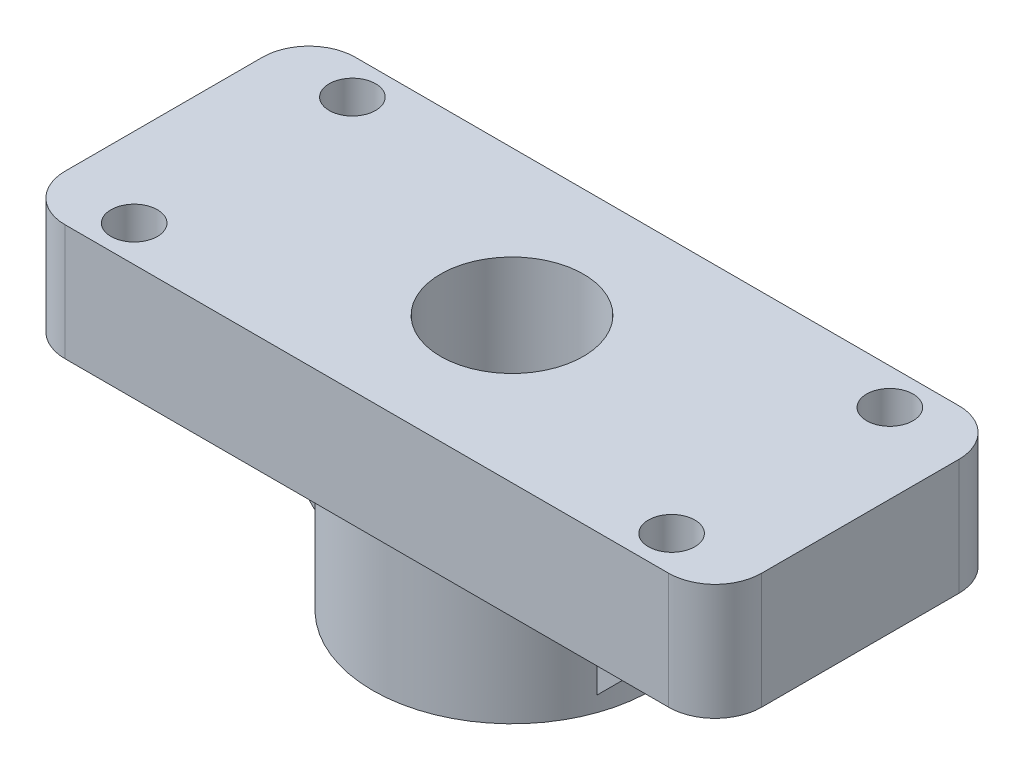
ISO-10303-21;
HEADER;
FILE_DESCRIPTION(('STEP AP214'),'2;1');
FILE_NAME('part.step','',(''),(''),'','','');
FILE_SCHEMA(('AUTOMOTIVE_DESIGN { 1 0 10303 214 1 1 1 1 }'));
ENDSEC;
DATA;
#1=APPLICATION_CONTEXT('core data for automotive mechanical design processes');
#2=APPLICATION_PROTOCOL_DEFINITION('international standard','automotive_design',2000,#1);
#3=PRODUCT_CONTEXT('',#1,'mechanical');
#4=PRODUCT('Part','Part','',(#3));
#5=PRODUCT_RELATED_PRODUCT_CATEGORY('part','',(#4));
#6=PRODUCT_DEFINITION_FORMATION('','',#4);
#7=PRODUCT_DEFINITION_CONTEXT('part definition',#1,'design');
#8=PRODUCT_DEFINITION('design','',#6,#7);
#9=PRODUCT_DEFINITION_SHAPE('','',#8);
#10=(LENGTH_UNIT() NAMED_UNIT(*) SI_UNIT(.MILLI.,.METRE.));
#11=(NAMED_UNIT(*) PLANE_ANGLE_UNIT() SI_UNIT($,.RADIAN.));
#12=(NAMED_UNIT(*) SI_UNIT($,.STERADIAN.) SOLID_ANGLE_UNIT());
#13=UNCERTAINTY_MEASURE_WITH_UNIT(LENGTH_MEASURE(1.E-05),#10,'distance_accuracy_value','');
#14=(GEOMETRIC_REPRESENTATION_CONTEXT(3) GLOBAL_UNCERTAINTY_ASSIGNED_CONTEXT((#13)) GLOBAL_UNIT_ASSIGNED_CONTEXT((#10,
#11,#12)) REPRESENTATION_CONTEXT('',''));
#15=CARTESIAN_POINT('',(0.,0.,0.));
#16=DIRECTION('',(0.,0.,1.));
#17=DIRECTION('',(1.,0.,0.));
#18=AXIS2_PLACEMENT_3D('',#15,#16,#17);
#19=CARTESIAN_POINT('',(-30.,10.,-12.5));
#20=DIRECTION('',(1.,0.,0.));
#21=DIRECTION('',(0.,0.,-1.));
#22=AXIS2_PLACEMENT_3D('',#19,#20,#21);
#23=PLANE('',#22);
#24=DIRECTION('',(0.,0.,1.));
#25=VECTOR('',#24,1.);
#26=CARTESIAN_POINT('',(-30.,10.,-12.5));
#27=LINE('',#26,#25);
#28=CARTESIAN_POINT('',(-30.,10.,-8.5));
#29=VERTEX_POINT('',#28);
#30=CARTESIAN_POINT('',(-30.,10.,8.5));
#31=VERTEX_POINT('',#30);
#32=EDGE_CURVE('E195',#29,#31,#27,.T.);
#33=ORIENTED_EDGE('',*,*,#32,.F.);
#34=DIRECTION('',(0.,-1.,0.));
#35=VECTOR('',#34,1.);
#36=CARTESIAN_POINT('',(-30.,10.,-8.5));
#37=LINE('',#36,#35);
#38=CARTESIAN_POINT('',(-30.,0.,-8.5));
#39=VERTEX_POINT('',#38);
#40=EDGE_CURVE('E230',#29,#39,#37,.T.);
#41=ORIENTED_EDGE('',*,*,#40,.T.);
#42=DIRECTION('',(0.,0.,1.));
#43=VECTOR('',#42,1.);
#44=CARTESIAN_POINT('',(-30.,0.,-12.5));
#45=LINE('',#44,#43);
#46=CARTESIAN_POINT('',(-30.,0.,8.5));
#47=VERTEX_POINT('',#46);
#48=EDGE_CURVE('E194',#39,#47,#45,.T.);
#49=ORIENTED_EDGE('',*,*,#48,.T.);
#50=DIRECTION('',(0.,-1.,0.));
#51=VECTOR('',#50,1.);
#52=CARTESIAN_POINT('',(-30.,10.,8.5));
#53=LINE('',#52,#51);
#54=EDGE_CURVE('E228',#47,#31,#53,.F.);
#55=ORIENTED_EDGE('',*,*,#54,.T.);
#56=EDGE_LOOP('',(#33,#41,#49,#55));
#57=FACE_BOUND('',#56,.T.);
#58=ADVANCED_FACE('F33',(#57),#23,.F.);
#59=CARTESIAN_POINT('',(-30.,10.,12.5));
#60=DIRECTION('',(0.,0.,-1.));
#61=DIRECTION('',(-1.,0.,0.));
#62=AXIS2_PLACEMENT_3D('',#59,#60,#61);
#63=PLANE('',#62);
#64=DIRECTION('',(1.,0.,0.));
#65=VECTOR('',#64,1.);
#66=CARTESIAN_POINT('',(-30.,0.,12.5));
#67=LINE('',#66,#65);
#68=CARTESIAN_POINT('',(-26.,0.,12.5));
#69=VERTEX_POINT('',#68);
#70=CARTESIAN_POINT('',(26.,0.,12.5));
#71=VERTEX_POINT('',#70);
#72=EDGE_CURVE('E209',#69,#71,#67,.T.);
#73=ORIENTED_EDGE('',*,*,#72,.T.);
#74=DIRECTION('',(0.,-1.,0.));
#75=VECTOR('',#74,1.);
#76=CARTESIAN_POINT('',(26.,10.,12.5));
#77=LINE('',#76,#75);
#78=CARTESIAN_POINT('',(26.,10.,12.5));
#79=VERTEX_POINT('',#78);
#80=EDGE_CURVE('E260',#71,#79,#77,.F.);
#81=ORIENTED_EDGE('',*,*,#80,.T.);
#82=DIRECTION('',(1.,0.,0.));
#83=VECTOR('',#82,1.);
#84=CARTESIAN_POINT('',(-30.,10.,12.5));
#85=LINE('',#84,#83);
#86=CARTESIAN_POINT('',(-26.,10.,12.5));
#87=VERTEX_POINT('',#86);
#88=EDGE_CURVE('E198',#87,#79,#85,.T.);
#89=ORIENTED_EDGE('',*,*,#88,.F.);
#90=DIRECTION('',(0.,-1.,0.));
#91=VECTOR('',#90,1.);
#92=CARTESIAN_POINT('',(-26.,10.,12.5));
#93=LINE('',#92,#91);
#94=EDGE_CURVE('E257',#87,#69,#93,.T.);
#95=ORIENTED_EDGE('',*,*,#94,.T.);
#96=EDGE_LOOP('',(#73,#81,#89,#95));
#97=FACE_BOUND('',#96,.T.);
#98=ADVANCED_FACE('F293',(#97),#63,.F.);
#99=CARTESIAN_POINT('',(30.,10.,-12.5));
#100=DIRECTION('',(-1.,0.,0.));
#101=DIRECTION('',(0.,0.,1.));
#102=AXIS2_PLACEMENT_3D('',#99,#100,#101);
#103=PLANE('',#102);
#104=DIRECTION('',(0.,0.,-1.));
#105=VECTOR('',#104,1.);
#106=CARTESIAN_POINT('',(30.,10.,-12.5));
#107=LINE('',#106,#105);
#108=CARTESIAN_POINT('',(30.,10.,8.5));
#109=VERTEX_POINT('',#108);
#110=CARTESIAN_POINT('',(30.,10.,-8.49999999999999));
#111=VERTEX_POINT('',#110);
#112=EDGE_CURVE('E201',#109,#111,#107,.T.);
#113=ORIENTED_EDGE('',*,*,#112,.F.);
#114=DIRECTION('',(0.,-1.,0.));
#115=VECTOR('',#114,1.);
#116=CARTESIAN_POINT('',(30.,10.,8.5));
#117=LINE('',#116,#115);
#118=CARTESIAN_POINT('',(30.,0.,8.5));
#119=VERTEX_POINT('',#118);
#120=EDGE_CURVE('E254',#109,#119,#117,.T.);
#121=ORIENTED_EDGE('',*,*,#120,.T.);
#122=DIRECTION('',(0.,0.,-1.));
#123=VECTOR('',#122,1.);
#124=CARTESIAN_POINT('',(30.,0.,-12.5));
#125=LINE('',#124,#123);
#126=CARTESIAN_POINT('',(30.,0.,-8.49999999999999));
#127=VERTEX_POINT('',#126);
#128=EDGE_CURVE('E212',#119,#127,#125,.T.);
#129=ORIENTED_EDGE('',*,*,#128,.T.);
#130=DIRECTION('',(0.,-1.,0.));
#131=VECTOR('',#130,1.);
#132=CARTESIAN_POINT('',(30.,10.,-8.49999999999999));
#133=LINE('',#132,#131);
#134=EDGE_CURVE('E48',#127,#111,#133,.F.);
#135=ORIENTED_EDGE('',*,*,#134,.T.);
#136=EDGE_LOOP('',(#113,#121,#129,#135));
#137=FACE_BOUND('',#136,.T.);
#138=ADVANCED_FACE('F299',(#137),#103,.F.);
#139=CARTESIAN_POINT('',(-30.,10.,-12.5));
#140=DIRECTION('',(0.,0.,1.));
#141=DIRECTION('',(1.,0.,0.));
#142=AXIS2_PLACEMENT_3D('',#139,#140,#141);
#143=PLANE('',#142);
#144=DIRECTION('',(-1.,0.,0.));
#145=VECTOR('',#144,1.);
#146=CARTESIAN_POINT('',(-30.,0.,-12.5));
#147=LINE('',#146,#145);
#148=CARTESIAN_POINT('',(26.,0.,-12.5));
#149=VERTEX_POINT('',#148);
#150=CARTESIAN_POINT('',(-26.,0.,-12.5));
#151=VERTEX_POINT('',#150);
#152=EDGE_CURVE('E199',#149,#151,#147,.T.);
#153=ORIENTED_EDGE('',*,*,#152,.T.);
#154=DIRECTION('',(0.,-1.,0.));
#155=VECTOR('',#154,1.);
#156=CARTESIAN_POINT('',(-26.,10.,-12.5));
#157=LINE('',#156,#155);
#158=CARTESIAN_POINT('',(-26.,10.,-12.5));
#159=VERTEX_POINT('',#158);
#160=EDGE_CURVE('E244',#151,#159,#157,.F.);
#161=ORIENTED_EDGE('',*,*,#160,.T.);
#162=DIRECTION('',(-1.,0.,0.));
#163=VECTOR('',#162,1.);
#164=CARTESIAN_POINT('',(-30.,10.,-12.5));
#165=LINE('',#164,#163);
#166=CARTESIAN_POINT('',(26.,10.,-12.5));
#167=VERTEX_POINT('',#166);
#168=EDGE_CURVE('E203',#167,#159,#165,.T.);
#169=ORIENTED_EDGE('',*,*,#168,.F.);
#170=DIRECTION('',(0.,-1.,0.));
#171=VECTOR('',#170,1.);
#172=CARTESIAN_POINT('',(26.,10.,-12.5));
#173=LINE('',#172,#171);
#174=EDGE_CURVE('E241',#167,#149,#173,.T.);
#175=ORIENTED_EDGE('',*,*,#174,.T.);
#176=EDGE_LOOP('',(#153,#161,#169,#175));
#177=FACE_BOUND('',#176,.T.);
#178=ADVANCED_FACE('F341',(#177),#143,.F.);
#179=CARTESIAN_POINT('',(-30.,10.,12.5));
#180=DIRECTION('',(0.,1.,0.));
#181=DIRECTION('',(0.,0.,1.));
#182=AXIS2_PLACEMENT_3D('',#179,#180,#181);
#183=PLANE('',#182);
#184=CARTESIAN_POINT('',(-23.15,10.,9.4));
#185=DIRECTION('',(0.,1.,0.));
#186=DIRECTION('',(0.,0.,1.));
#187=AXIS2_PLACEMENT_3D('',#184,#185,#186);
#188=CIRCLE('',#187,2.);
#189=CARTESIAN_POINT('',(-23.15,10.,11.4));
#190=VERTEX_POINT('',#189);
#191=EDGE_CURVE('E275',#190,#190,#188,.T.);
#192=ORIENTED_EDGE('',*,*,#191,.F.);
#193=EDGE_LOOP('',(#192));
#194=FACE_BOUND('',#193,.T.);
#195=CARTESIAN_POINT('',(-23.15,10.,-9.4));
#196=DIRECTION('',(0.,1.,0.));
#197=DIRECTION('',(0.,0.,1.));
#198=AXIS2_PLACEMENT_3D('',#195,#196,#197);
#199=CIRCLE('',#198,2.);
#200=CARTESIAN_POINT('',(-23.15,10.,-7.4));
#201=VERTEX_POINT('',#200);
#202=EDGE_CURVE('E272',#201,#201,#199,.T.);
#203=ORIENTED_EDGE('',*,*,#202,.F.);
#204=EDGE_LOOP('',(#203));
#205=FACE_BOUND('',#204,.T.);
#206=CARTESIAN_POINT('',(23.15,10.,9.4));
#207=DIRECTION('',(0.,1.,0.));
#208=DIRECTION('',(0.,0.,1.));
#209=AXIS2_PLACEMENT_3D('',#206,#207,#208);
#210=CIRCLE('',#209,2.);
#211=CARTESIAN_POINT('',(23.15,10.,11.4));
#212=VERTEX_POINT('',#211);
#213=EDGE_CURVE('E268',#212,#212,#210,.T.);
#214=ORIENTED_EDGE('',*,*,#213,.F.);
#215=EDGE_LOOP('',(#214));
#216=FACE_BOUND('',#215,.T.);
#217=CARTESIAN_POINT('',(23.15,10.,-9.4));
#218=DIRECTION('',(0.,1.,0.));
#219=DIRECTION('',(0.,0.,1.));
#220=AXIS2_PLACEMENT_3D('',#217,#218,#219);
#221=CIRCLE('',#220,2.);
#222=CARTESIAN_POINT('',(23.15,10.,-7.39999999999999));
#223=VERTEX_POINT('',#222);
#224=EDGE_CURVE('E264',#223,#223,#221,.T.);
#225=ORIENTED_EDGE('',*,*,#224,.F.);
#226=EDGE_LOOP('',(#225));
#227=FACE_BOUND('',#226,.T.);
#228=CARTESIAN_POINT('',(0.,10.,0.));
#229=DIRECTION('',(0.,1.,0.));
#230=DIRECTION('',(0.,0.,1.));
#231=AXIS2_PLACEMENT_3D('',#228,#229,#230);
#232=CIRCLE('',#231,6.15);
#233=CARTESIAN_POINT('',(0.,10.,6.15));
#234=VERTEX_POINT('',#233);
#235=EDGE_CURVE('E180',#234,#234,#232,.T.);
#236=ORIENTED_EDGE('',*,*,#235,.F.);
#237=EDGE_LOOP('',(#236));
#238=FACE_BOUND('',#237,.T.);
#239=ORIENTED_EDGE('',*,*,#168,.T.);
#240=CARTESIAN_POINT('',(-26.,10.,-8.5));
#241=DIRECTION('',(0.,1.,0.));
#242=DIRECTION('',(0.,0.,1.));
#243=AXIS2_PLACEMENT_3D('',#240,#241,#242);
#244=CIRCLE('',#243,4.);
#245=EDGE_CURVE('E251',#159,#29,#244,.T.);
#246=ORIENTED_EDGE('',*,*,#245,.T.);
#247=ORIENTED_EDGE('',*,*,#32,.T.);
#248=CARTESIAN_POINT('',(-26.,10.,8.5));
#249=DIRECTION('',(0.,1.,0.));
#250=DIRECTION('',(0.,0.,1.));
#251=AXIS2_PLACEMENT_3D('',#248,#249,#250);
#252=CIRCLE('',#251,4.);
#253=EDGE_CURVE('E246',#31,#87,#252,.T.);
#254=ORIENTED_EDGE('',*,*,#253,.T.);
#255=ORIENTED_EDGE('',*,*,#88,.T.);
#256=CARTESIAN_POINT('',(26.,10.,8.5));
#257=DIRECTION('',(0.,1.,0.));
#258=DIRECTION('',(0.,0.,1.));
#259=AXIS2_PLACEMENT_3D('',#256,#257,#258);
#260=CIRCLE('',#259,4.);
#261=EDGE_CURVE('E55',#79,#109,#260,.T.);
#262=ORIENTED_EDGE('',*,*,#261,.T.);
#263=ORIENTED_EDGE('',*,*,#112,.T.);
#264=CARTESIAN_POINT('',(26.,10.,-8.49999999999999));
#265=DIRECTION('',(0.,1.,0.));
#266=DIRECTION('',(0.,0.,1.));
#267=AXIS2_PLACEMENT_3D('',#264,#265,#266);
#268=CIRCLE('',#267,4.);
#269=EDGE_CURVE('E248',#111,#167,#268,.T.);
#270=ORIENTED_EDGE('',*,*,#269,.T.);
#271=EDGE_LOOP('',(#239,#246,#247,#254,#255,#262,#263,#270));
#272=FACE_BOUND('',#271,.T.);
#273=ADVANCED_FACE('F330',(#194,#205,#216,#227,#238,#272),#183,.T.);
#274=CARTESIAN_POINT('',(-30.,0.,12.5));
#275=DIRECTION('',(0.,1.,0.));
#276=DIRECTION('',(0.,0.,1.));
#277=AXIS2_PLACEMENT_3D('',#274,#275,#276);
#278=PLANE('',#277);
#279=CARTESIAN_POINT('',(-23.15,0.,9.4));
#280=DIRECTION('',(0.,1.,0.));
#281=DIRECTION('',(0.,0.,1.));
#282=AXIS2_PLACEMENT_3D('',#279,#280,#281);
#283=CIRCLE('',#282,2.);
#284=CARTESIAN_POINT('',(-23.15,0.,11.4));
#285=VERTEX_POINT('',#284);
#286=EDGE_CURVE('E273',#285,#285,#283,.T.);
#287=ORIENTED_EDGE('',*,*,#286,.T.);
#288=EDGE_LOOP('',(#287));
#289=FACE_BOUND('',#288,.T.);
#290=CARTESIAN_POINT('',(-23.15,0.,-9.4));
#291=DIRECTION('',(0.,1.,0.));
#292=DIRECTION('',(0.,0.,1.));
#293=AXIS2_PLACEMENT_3D('',#290,#291,#292);
#294=CIRCLE('',#293,2.);
#295=CARTESIAN_POINT('',(-23.15,0.,-7.4));
#296=VERTEX_POINT('',#295);
#297=EDGE_CURVE('E269',#296,#296,#294,.T.);
#298=ORIENTED_EDGE('',*,*,#297,.T.);
#299=EDGE_LOOP('',(#298));
#300=FACE_BOUND('',#299,.T.);
#301=CARTESIAN_POINT('',(23.15,0.,9.4));
#302=DIRECTION('',(0.,1.,0.));
#303=DIRECTION('',(0.,0.,1.));
#304=AXIS2_PLACEMENT_3D('',#301,#302,#303);
#305=CIRCLE('',#304,2.);
#306=CARTESIAN_POINT('',(23.15,0.,11.4));
#307=VERTEX_POINT('',#306);
#308=EDGE_CURVE('E265',#307,#307,#305,.T.);
#309=ORIENTED_EDGE('',*,*,#308,.T.);
#310=EDGE_LOOP('',(#309));
#311=FACE_BOUND('',#310,.T.);
#312=CARTESIAN_POINT('',(23.15,0.,-9.4));
#313=DIRECTION('',(0.,1.,0.));
#314=DIRECTION('',(0.,0.,1.));
#315=AXIS2_PLACEMENT_3D('',#312,#313,#314);
#316=CIRCLE('',#315,2.);
#317=CARTESIAN_POINT('',(23.15,0.,-7.39999999999999));
#318=VERTEX_POINT('',#317);
#319=EDGE_CURVE('E144',#318,#318,#316,.T.);
#320=ORIENTED_EDGE('',*,*,#319,.T.);
#321=EDGE_LOOP('',(#320));
#322=FACE_BOUND('',#321,.T.);
#323=DIRECTION('',(0.,0.,1.));
#324=VECTOR('',#323,1.);
#325=CARTESIAN_POINT('',(22.,0.,-4.));
#326=LINE('',#325,#324);
#327=CARTESIAN_POINT('',(22.,0.,-4.));
#328=VERTEX_POINT('',#327);
#329=CARTESIAN_POINT('',(22.,0.,4.));
#330=VERTEX_POINT('',#329);
#331=EDGE_CURVE('E147',#328,#330,#326,.T.);
#332=ORIENTED_EDGE('',*,*,#331,.F.);
#333=DIRECTION('',(-1.,0.,0.));
#334=VECTOR('',#333,1.);
#335=CARTESIAN_POINT('',(22.,0.,-4.));
#336=LINE('',#335,#334);
#337=CARTESIAN_POINT('',(11.3137084989848,0.,-4.));
#338=VERTEX_POINT('',#337);
#339=EDGE_CURVE('E155',#328,#338,#336,.T.);
#340=ORIENTED_EDGE('',*,*,#339,.T.);
#341=CARTESIAN_POINT('',(0.,0.,0.));
#342=DIRECTION('',(0.,1.,0.));
#343=DIRECTION('',(0.,0.,1.));
#344=AXIS2_PLACEMENT_3D('',#341,#342,#343);
#345=CIRCLE('',#344,12.);
#346=CARTESIAN_POINT('',(-11.3137084989848,0.,-4.));
#347=VERTEX_POINT('',#346);
#348=EDGE_CURVE('E183',#338,#347,#345,.T.);
#349=ORIENTED_EDGE('',*,*,#348,.T.);
#350=DIRECTION('',(-1.,0.,0.));
#351=VECTOR('',#350,1.);
#352=CARTESIAN_POINT('',(-22.,0.,-4.));
#353=LINE('',#352,#351);
#354=CARTESIAN_POINT('',(-22.,0.,-4.));
#355=VERTEX_POINT('',#354);
#356=EDGE_CURVE('E174',#347,#355,#353,.T.);
#357=ORIENTED_EDGE('',*,*,#356,.T.);
#358=DIRECTION('',(0.,0.,1.));
#359=VECTOR('',#358,1.);
#360=CARTESIAN_POINT('',(-22.,0.,-4.));
#361=LINE('',#360,#359);
#362=CARTESIAN_POINT('',(-22.,0.,4.));
#363=VERTEX_POINT('',#362);
#364=EDGE_CURVE('E177',#355,#363,#361,.T.);
#365=ORIENTED_EDGE('',*,*,#364,.T.);
#366=DIRECTION('',(-1.,0.,0.));
#367=VECTOR('',#366,1.);
#368=CARTESIAN_POINT('',(-22.,0.,4.));
#369=LINE('',#368,#367);
#370=CARTESIAN_POINT('',(-11.3137084989848,0.,4.));
#371=VERTEX_POINT('',#370);
#372=EDGE_CURVE('E169',#371,#363,#369,.T.);
#373=ORIENTED_EDGE('',*,*,#372,.F.);
#374=CARTESIAN_POINT('',(11.3137084989848,0.,4.));
#375=VERTEX_POINT('',#374);
#376=EDGE_CURVE('E162',#371,#375,#345,.T.);
#377=ORIENTED_EDGE('',*,*,#376,.T.);
#378=DIRECTION('',(-1.,0.,0.));
#379=VECTOR('',#378,1.);
#380=CARTESIAN_POINT('',(22.,0.,4.));
#381=LINE('',#380,#379);
#382=EDGE_CURVE('E139',#330,#375,#381,.T.);
#383=ORIENTED_EDGE('',*,*,#382,.F.);
#384=EDGE_LOOP('',(#332,#340,#349,#357,#365,#373,#377,#383));
#385=FACE_BOUND('',#384,.T.);
#386=ORIENTED_EDGE('',*,*,#48,.F.);
#387=CARTESIAN_POINT('',(-26.,0.,-8.5));
#388=DIRECTION('',(0.,1.,0.));
#389=DIRECTION('',(0.,0.,1.));
#390=AXIS2_PLACEMENT_3D('',#387,#388,#389);
#391=CIRCLE('',#390,4.);
#392=EDGE_CURVE('E239',#39,#151,#391,.F.);
#393=ORIENTED_EDGE('',*,*,#392,.T.);
#394=ORIENTED_EDGE('',*,*,#152,.F.);
#395=CARTESIAN_POINT('',(26.,0.,-8.49999999999999));
#396=DIRECTION('',(0.,1.,0.));
#397=DIRECTION('',(0.,0.,1.));
#398=AXIS2_PLACEMENT_3D('',#395,#396,#397);
#399=CIRCLE('',#398,4.);
#400=EDGE_CURVE('E235',#149,#127,#399,.F.);
#401=ORIENTED_EDGE('',*,*,#400,.T.);
#402=ORIENTED_EDGE('',*,*,#128,.F.);
#403=CARTESIAN_POINT('',(26.,0.,8.5));
#404=DIRECTION('',(0.,1.,0.));
#405=DIRECTION('',(0.,0.,1.));
#406=AXIS2_PLACEMENT_3D('',#403,#404,#405);
#407=CIRCLE('',#406,4.);
#408=EDGE_CURVE('E237',#119,#71,#407,.F.);
#409=ORIENTED_EDGE('',*,*,#408,.T.);
#410=ORIENTED_EDGE('',*,*,#72,.F.);
#411=CARTESIAN_POINT('',(-26.,0.,8.5));
#412=DIRECTION('',(0.,1.,0.));
#413=DIRECTION('',(0.,0.,1.));
#414=AXIS2_PLACEMENT_3D('',#411,#412,#413);
#415=CIRCLE('',#414,4.);
#416=EDGE_CURVE('E233',#69,#47,#415,.F.);
#417=ORIENTED_EDGE('',*,*,#416,.T.);
#418=EDGE_LOOP('',(#386,#393,#394,#401,#402,#409,#410,#417));
#419=FACE_BOUND('',#418,.T.);
#420=ADVANCED_FACE('F158',(#289,#300,#311,#322,#385,#419),#278,.F.);
#421=CARTESIAN_POINT('',(0.,0.,0.));
#422=DIRECTION('',(0.,1.,0.));
#423=DIRECTION('',(0.,0.,1.));
#424=AXIS2_PLACEMENT_3D('',#421,#422,#423);
#425=CYLINDRICAL_SURFACE('',#424,6.15);
#426=CARTESIAN_POINT('',(0.,-7.,0.));
#427=DIRECTION('',(0.,1.,0.));
#428=DIRECTION('',(0.,0.,1.));
#429=AXIS2_PLACEMENT_3D('',#426,#427,#428);
#430=CIRCLE('',#429,6.15);
#431=CARTESIAN_POINT('',(0.,-7.,6.15));
#432=VERTEX_POINT('',#431);
#433=EDGE_CURVE('E191',#432,#432,#430,.T.);
#434=ORIENTED_EDGE('',*,*,#433,.F.);
#435=EDGE_LOOP('',(#434));
#436=FACE_BOUND('',#435,.T.);
#437=ORIENTED_EDGE('',*,*,#235,.T.);
#438=EDGE_LOOP('',(#437));
#439=FACE_BOUND('',#438,.T.);
#440=ADVANCED_FACE('F355',(#436,#439),#425,.F.);
#441=CARTESIAN_POINT('',(-6.15,-7.,0.));
#442=DIRECTION('',(0.,1.,0.));
#443=DIRECTION('',(0.,0.,1.));
#444=AXIS2_PLACEMENT_3D('',#441,#442,#443);
#445=PLANE('',#444);
#446=ORIENTED_EDGE('',*,*,#433,.T.);
#447=EDGE_LOOP('',(#446));
#448=FACE_BOUND('',#447,.T.);
#449=CARTESIAN_POINT('',(0.,-7.,0.));
#450=DIRECTION('',(0.,1.,0.));
#451=DIRECTION('',(0.,0.,1.));
#452=AXIS2_PLACEMENT_3D('',#449,#450,#451);
#453=CIRCLE('',#452,5.4);
#454=CARTESIAN_POINT('',(0.,-7.,5.4));
#455=VERTEX_POINT('',#454);
#456=EDGE_CURVE('E188',#455,#455,#453,.T.);
#457=ORIENTED_EDGE('',*,*,#456,.F.);
#458=EDGE_LOOP('',(#457));
#459=FACE_BOUND('',#458,.T.);
#460=ADVANCED_FACE('F360',(#448,#459),#445,.T.);
#461=CARTESIAN_POINT('',(0.,0.,0.));
#462=DIRECTION('',(0.,1.,0.));
#463=DIRECTION('',(0.,0.,1.));
#464=AXIS2_PLACEMENT_3D('',#461,#462,#463);
#465=CYLINDRICAL_SURFACE('',#464,5.4);
#466=CARTESIAN_POINT('',(0.,-9.99999999999999,0.));
#467=DIRECTION('',(0.,-1.,0.));
#468=DIRECTION('',(0.,0.,-1.));
#469=AXIS2_PLACEMENT_3D('',#466,#467,#468);
#470=CIRCLE('',#469,5.4);
#471=CARTESIAN_POINT('',(0.,-9.99999999999999,-5.4));
#472=VERTEX_POINT('',#471);
#473=EDGE_CURVE('E11',#472,#472,#470,.T.);
#474=ORIENTED_EDGE('',*,*,#473,.T.);
#475=EDGE_LOOP('',(#474));
#476=FACE_BOUND('',#475,.T.);
#477=ORIENTED_EDGE('',*,*,#456,.T.);
#478=EDGE_LOOP('',(#477));
#479=FACE_BOUND('',#478,.T.);
#480=ADVANCED_FACE('F364',(#476,#479),#465,.F.);
#481=CARTESIAN_POINT('',(-5.4,-12.,0.));
#482=DIRECTION('',(0.,-1.,0.));
#483=DIRECTION('',(0.,0.,-1.));
#484=AXIS2_PLACEMENT_3D('',#481,#482,#483);
#485=PLANE('',#484);
#486=CARTESIAN_POINT('',(0.,-12.,0.));
#487=DIRECTION('',(0.,-1.,0.));
#488=DIRECTION('',(0.,0.,-1.));
#489=AXIS2_PLACEMENT_3D('',#486,#487,#488);
#490=CIRCLE('',#489,7.4);
#491=CARTESIAN_POINT('',(0.,-12.,-7.4));
#492=VERTEX_POINT('',#491);
#493=EDGE_CURVE('E41',#492,#492,#490,.F.);
#494=ORIENTED_EDGE('',*,*,#493,.T.);
#495=EDGE_LOOP('',(#494));
#496=FACE_BOUND('',#495,.T.);
#497=CARTESIAN_POINT('',(0.,-12.,0.));
#498=DIRECTION('',(0.,1.,0.));
#499=DIRECTION('',(0.,0.,1.));
#500=AXIS2_PLACEMENT_3D('',#497,#498,#499);
#501=CIRCLE('',#500,12.);
#502=CARTESIAN_POINT('',(0.,-12.,12.));
#503=VERTEX_POINT('',#502);
#504=EDGE_CURVE('E185',#503,#503,#501,.T.);
#505=ORIENTED_EDGE('',*,*,#504,.F.);
#506=EDGE_LOOP('',(#505));
#507=FACE_BOUND('',#506,.T.);
#508=ADVANCED_FACE('F279',(#496,#507),#485,.T.);
#509=CARTESIAN_POINT('',(0.,0.,0.));
#510=DIRECTION('',(0.,1.,0.));
#511=DIRECTION('',(0.,0.,1.));
#512=AXIS2_PLACEMENT_3D('',#509,#510,#511);
#513=CYLINDRICAL_SURFACE('',#512,12.);
#514=DIRECTION('',(0.,1.,0.));
#515=VECTOR('',#514,1.);
#516=CARTESIAN_POINT('',(11.3137084989848,0.,-4.));
#517=LINE('',#516,#515);
#518=CARTESIAN_POINT('',(11.3137084989848,-10.6862915010151,-4.));
#519=VERTEX_POINT('',#518);
#520=EDGE_CURVE('E226',#519,#338,#517,.T.);
#521=ORIENTED_EDGE('',*,*,#520,.F.);
#522=CARTESIAN_POINT('',(0.,-21.9999999999998,0.));
#523=DIRECTION('',(0.707106781186544,-0.707106781186551,0.));
#524=DIRECTION('',(0.707106781186551,0.707106781186544,0.));
#525=AXIS2_PLACEMENT_3D('',#522,#523,#524);
#526=ELLIPSE('',#525,16.970562748477,12.);
#527=CARTESIAN_POINT('',(11.3137084989848,-10.6862915010151,4.));
#528=VERTEX_POINT('',#527);
#529=EDGE_CURVE('E224',#528,#519,#526,.F.);
#530=ORIENTED_EDGE('',*,*,#529,.F.);
#531=DIRECTION('',(0.,1.,0.));
#532=VECTOR('',#531,1.);
#533=CARTESIAN_POINT('',(11.3137084989848,0.,4.));
#534=LINE('',#533,#532);
#535=EDGE_CURVE('E141',#528,#375,#534,.T.);
#536=ORIENTED_EDGE('',*,*,#535,.T.);
#537=ORIENTED_EDGE('',*,*,#376,.F.);
#538=DIRECTION('',(0.,1.,0.));
#539=VECTOR('',#538,1.);
#540=CARTESIAN_POINT('',(-11.3137084989848,0.,4.));
#541=LINE('',#540,#539);
#542=CARTESIAN_POINT('',(-11.3137084989848,-10.6862915010151,4.));
#543=VERTEX_POINT('',#542);
#544=EDGE_CURVE('E206',#371,#543,#541,.F.);
#545=ORIENTED_EDGE('',*,*,#544,.T.);
#546=CARTESIAN_POINT('',(0.,-21.9999999999998,0.));
#547=DIRECTION('',(-0.707106781186544,-0.707106781186551,0.));
#548=DIRECTION('',(-0.707106781186551,0.707106781186544,0.));
#549=AXIS2_PLACEMENT_3D('',#546,#547,#548);
#550=ELLIPSE('',#549,16.970562748477,12.);
#551=CARTESIAN_POINT('',(-11.3137084989848,-10.6862915010151,-4.));
#552=VERTEX_POINT('',#551);
#553=EDGE_CURVE('E218',#552,#543,#550,.F.);
#554=ORIENTED_EDGE('',*,*,#553,.F.);
#555=DIRECTION('',(0.,1.,0.));
#556=VECTOR('',#555,1.);
#557=CARTESIAN_POINT('',(-11.3137084989848,0.,-4.));
#558=LINE('',#557,#556);
#559=EDGE_CURVE('E221',#347,#552,#558,.F.);
#560=ORIENTED_EDGE('',*,*,#559,.F.);
#561=ORIENTED_EDGE('',*,*,#348,.F.);
#562=EDGE_LOOP('',(#521,#530,#536,#537,#545,#554,#560,#561));
#563=FACE_BOUND('',#562,.T.);
#564=ORIENTED_EDGE('',*,*,#504,.T.);
#565=EDGE_LOOP('',(#564));
#566=FACE_BOUND('',#565,.T.);
#567=ADVANCED_FACE('F371',(#563,#566),#513,.T.);
#568=CARTESIAN_POINT('',(-9.99999999999987,-12.,-4.));
#569=DIRECTION('',(-0.707106781186544,-0.707106781186551,0.));
#570=DIRECTION('',(0.707106781186551,-0.707106781186544,0.));
#571=AXIS2_PLACEMENT_3D('',#568,#569,#570);
#572=PLANE('',#571);
#573=DIRECTION('',(0.707106781186551,-0.707106781186544,0.));
#574=VECTOR('',#573,1.);
#575=CARTESIAN_POINT('',(-9.99999999999987,-12.,-4.));
#576=LINE('',#575,#574);
#577=EDGE_CURVE('E171',#355,#552,#576,.T.);
#578=ORIENTED_EDGE('',*,*,#577,.T.);
#579=ORIENTED_EDGE('',*,*,#553,.T.);
#580=DIRECTION('',(0.707106781186551,-0.707106781186544,0.));
#581=VECTOR('',#580,1.);
#582=CARTESIAN_POINT('',(-9.99999999999987,-12.,4.));
#583=LINE('',#582,#581);
#584=EDGE_CURVE('E154',#363,#543,#583,.T.);
#585=ORIENTED_EDGE('',*,*,#584,.F.);
#586=ORIENTED_EDGE('',*,*,#364,.F.);
#587=EDGE_LOOP('',(#578,#579,#585,#586));
#588=FACE_BOUND('',#587,.T.);
#589=ADVANCED_FACE('F374',(#588),#572,.T.);
#590=CARTESIAN_POINT('',(-22.,0.,-4.));
#591=DIRECTION('',(0.,0.,-1.));
#592=DIRECTION('',(-1.,0.,0.));
#593=AXIS2_PLACEMENT_3D('',#590,#591,#592);
#594=PLANE('',#593);
#595=ORIENTED_EDGE('',*,*,#356,.F.);
#596=ORIENTED_EDGE('',*,*,#559,.T.);
#597=ORIENTED_EDGE('',*,*,#577,.F.);
#598=EDGE_LOOP('',(#595,#596,#597));
#599=FACE_BOUND('',#598,.T.);
#600=ADVANCED_FACE('F378',(#599),#594,.T.);
#601=CARTESIAN_POINT('',(-22.,0.,4.));
#602=DIRECTION('',(0.,0.,-1.));
#603=DIRECTION('',(-1.,0.,0.));
#604=AXIS2_PLACEMENT_3D('',#601,#602,#603);
#605=PLANE('',#604);
#606=ORIENTED_EDGE('',*,*,#544,.F.);
#607=ORIENTED_EDGE('',*,*,#372,.T.);
#608=ORIENTED_EDGE('',*,*,#584,.T.);
#609=EDGE_LOOP('',(#606,#607,#608));
#610=FACE_BOUND('',#609,.T.);
#611=ADVANCED_FACE('F382',(#610),#605,.F.);
#612=CARTESIAN_POINT('',(9.99999999999987,-12.,-4.));
#613=DIRECTION('',(0.707106781186544,-0.707106781186551,0.));
#614=DIRECTION('',(0.707106781186551,0.707106781186544,0.));
#615=AXIS2_PLACEMENT_3D('',#612,#613,#614);
#616=PLANE('',#615);
#617=DIRECTION('',(0.707106781186551,0.707106781186544,0.));
#618=VECTOR('',#617,1.);
#619=CARTESIAN_POINT('',(9.99999999999987,-12.,4.));
#620=LINE('',#619,#618);
#621=EDGE_CURVE('E135',#528,#330,#620,.T.);
#622=ORIENTED_EDGE('',*,*,#621,.F.);
#623=ORIENTED_EDGE('',*,*,#529,.T.);
#624=DIRECTION('',(0.707106781186551,0.707106781186544,0.));
#625=VECTOR('',#624,1.);
#626=CARTESIAN_POINT('',(9.99999999999987,-12.,-4.));
#627=LINE('',#626,#625);
#628=EDGE_CURVE('E150',#519,#328,#627,.T.);
#629=ORIENTED_EDGE('',*,*,#628,.T.);
#630=ORIENTED_EDGE('',*,*,#331,.T.);
#631=EDGE_LOOP('',(#622,#623,#629,#630));
#632=FACE_BOUND('',#631,.T.);
#633=ADVANCED_FACE('F148',(#632),#616,.T.);
#634=CARTESIAN_POINT('',(9.99999999999987,0.,-4.));
#635=DIRECTION('',(0.,0.,-1.));
#636=DIRECTION('',(-1.,0.,0.));
#637=AXIS2_PLACEMENT_3D('',#634,#635,#636);
#638=PLANE('',#637);
#639=ORIENTED_EDGE('',*,*,#628,.F.);
#640=ORIENTED_EDGE('',*,*,#520,.T.);
#641=ORIENTED_EDGE('',*,*,#339,.F.);
#642=EDGE_LOOP('',(#639,#640,#641));
#643=FACE_BOUND('',#642,.T.);
#644=ADVANCED_FACE('F389',(#643),#638,.T.);
#645=CARTESIAN_POINT('',(9.99999999999987,0.,4.));
#646=DIRECTION('',(0.,0.,-1.));
#647=DIRECTION('',(-1.,0.,0.));
#648=AXIS2_PLACEMENT_3D('',#645,#646,#647);
#649=PLANE('',#648);
#650=ORIENTED_EDGE('',*,*,#535,.F.);
#651=ORIENTED_EDGE('',*,*,#621,.T.);
#652=ORIENTED_EDGE('',*,*,#382,.T.);
#653=EDGE_LOOP('',(#650,#651,#652));
#654=FACE_BOUND('',#653,.T.);
#655=ADVANCED_FACE('F137',(#654),#649,.F.);
#656=CARTESIAN_POINT('',(-26.,10.,-8.5));
#657=DIRECTION('',(0.,-1.,0.));
#658=DIRECTION('',(0.,0.,-1.));
#659=AXIS2_PLACEMENT_3D('',#656,#657,#658);
#660=CYLINDRICAL_SURFACE('',#659,4.);
#661=ORIENTED_EDGE('',*,*,#245,.F.);
#662=ORIENTED_EDGE('',*,*,#160,.F.);
#663=ORIENTED_EDGE('',*,*,#392,.F.);
#664=ORIENTED_EDGE('',*,*,#40,.F.);
#665=EDGE_LOOP('',(#661,#662,#663,#664));
#666=FACE_BOUND('',#665,.T.);
#667=ADVANCED_FACE('F305',(#666),#660,.T.);
#668=CARTESIAN_POINT('',(26.,10.,8.5));
#669=DIRECTION('',(0.,-1.,0.));
#670=DIRECTION('',(0.,0.,-1.));
#671=AXIS2_PLACEMENT_3D('',#668,#669,#670);
#672=CYLINDRICAL_SURFACE('',#671,4.);
#673=ORIENTED_EDGE('',*,*,#261,.F.);
#674=ORIENTED_EDGE('',*,*,#80,.F.);
#675=ORIENTED_EDGE('',*,*,#408,.F.);
#676=ORIENTED_EDGE('',*,*,#120,.F.);
#677=EDGE_LOOP('',(#673,#674,#675,#676));
#678=FACE_BOUND('',#677,.T.);
#679=ADVANCED_FACE('F308',(#678),#672,.T.);
#680=CARTESIAN_POINT('',(26.,10.,-8.49999999999999));
#681=DIRECTION('',(0.,-1.,0.));
#682=DIRECTION('',(0.,0.,-1.));
#683=AXIS2_PLACEMENT_3D('',#680,#681,#682);
#684=CYLINDRICAL_SURFACE('',#683,4.);
#685=ORIENTED_EDGE('',*,*,#269,.F.);
#686=ORIENTED_EDGE('',*,*,#134,.F.);
#687=ORIENTED_EDGE('',*,*,#400,.F.);
#688=ORIENTED_EDGE('',*,*,#174,.F.);
#689=EDGE_LOOP('',(#685,#686,#687,#688));
#690=FACE_BOUND('',#689,.T.);
#691=ADVANCED_FACE('F312',(#690),#684,.T.);
#692=CARTESIAN_POINT('',(-26.,10.,8.5));
#693=DIRECTION('',(0.,-1.,0.));
#694=DIRECTION('',(0.,0.,-1.));
#695=AXIS2_PLACEMENT_3D('',#692,#693,#694);
#696=CYLINDRICAL_SURFACE('',#695,4.);
#697=ORIENTED_EDGE('',*,*,#253,.F.);
#698=ORIENTED_EDGE('',*,*,#54,.F.);
#699=ORIENTED_EDGE('',*,*,#416,.F.);
#700=ORIENTED_EDGE('',*,*,#94,.F.);
#701=EDGE_LOOP('',(#697,#698,#699,#700));
#702=FACE_BOUND('',#701,.T.);
#703=ADVANCED_FACE('F315',(#702),#696,.T.);
#704=CARTESIAN_POINT('',(23.15,-12.,-9.4));
#705=DIRECTION('',(0.,1.,0.));
#706=DIRECTION('',(0.,0.,1.));
#707=AXIS2_PLACEMENT_3D('',#704,#705,#706);
#708=CYLINDRICAL_SURFACE('',#707,2.);
#709=ORIENTED_EDGE('',*,*,#224,.T.);
#710=EDGE_LOOP('',(#709));
#711=FACE_BOUND('',#710,.T.);
#712=ORIENTED_EDGE('',*,*,#319,.F.);
#713=EDGE_LOOP('',(#712));
#714=FACE_BOUND('',#713,.T.);
#715=ADVANCED_FACE('F318',(#711,#714),#708,.F.);
#716=CARTESIAN_POINT('',(23.15,-12.,9.4));
#717=DIRECTION('',(0.,1.,0.));
#718=DIRECTION('',(0.,0.,1.));
#719=AXIS2_PLACEMENT_3D('',#716,#717,#718);
#720=CYLINDRICAL_SURFACE('',#719,2.);
#721=ORIENTED_EDGE('',*,*,#213,.T.);
#722=EDGE_LOOP('',(#721));
#723=FACE_BOUND('',#722,.T.);
#724=ORIENTED_EDGE('',*,*,#308,.F.);
#725=EDGE_LOOP('',(#724));
#726=FACE_BOUND('',#725,.T.);
#727=ADVANCED_FACE('F323',(#723,#726),#720,.F.);
#728=CARTESIAN_POINT('',(-23.15,-12.,-9.4));
#729=DIRECTION('',(0.,1.,0.));
#730=DIRECTION('',(0.,0.,1.));
#731=AXIS2_PLACEMENT_3D('',#728,#729,#730);
#732=CYLINDRICAL_SURFACE('',#731,2.);
#733=ORIENTED_EDGE('',*,*,#202,.T.);
#734=EDGE_LOOP('',(#733));
#735=FACE_BOUND('',#734,.T.);
#736=ORIENTED_EDGE('',*,*,#297,.F.);
#737=EDGE_LOOP('',(#736));
#738=FACE_BOUND('',#737,.T.);
#739=ADVANCED_FACE('F288',(#735,#738),#732,.F.);
#740=CARTESIAN_POINT('',(-23.15,-12.,9.4));
#741=DIRECTION('',(0.,1.,0.));
#742=DIRECTION('',(0.,0.,1.));
#743=AXIS2_PLACEMENT_3D('',#740,#741,#742);
#744=CYLINDRICAL_SURFACE('',#743,2.);
#745=ORIENTED_EDGE('',*,*,#191,.T.);
#746=EDGE_LOOP('',(#745));
#747=FACE_BOUND('',#746,.T.);
#748=ORIENTED_EDGE('',*,*,#286,.F.);
#749=EDGE_LOOP('',(#748));
#750=FACE_BOUND('',#749,.T.);
#751=ADVANCED_FACE('F283',(#747,#750),#744,.F.);
#752=CARTESIAN_POINT('',(0.,-12.,0.));
#753=DIRECTION('',(0.,-1.,0.));
#754=DIRECTION('',(0.,0.,-1.));
#755=AXIS2_PLACEMENT_3D('',#752,#753,#754);
#756=CONICAL_SURFACE('',#755,7.4,0.785398163397446);
#757=ORIENTED_EDGE('',*,*,#473,.F.);
#758=EDGE_LOOP('',(#757));
#759=FACE_BOUND('',#758,.T.);
#760=ORIENTED_EDGE('',*,*,#493,.F.);
#761=EDGE_LOOP('',(#760));
#762=FACE_BOUND('',#761,.T.);
#763=ADVANCED_FACE('F35',(#759,#762),#756,.F.);
#764=CLOSED_SHELL('',(#58,#98,#138,#178,#273,#420,#440,#460,#480,#508,#567,#589,#600,#611,#633,
#644,#655,#667,#679,#691,#703,#715,#727,#739,#751,#763));
#765=MANIFOLD_SOLID_BREP('B2',#764);
#766=ADVANCED_BREP_SHAPE_REPRESENTATION('',(#18,#765),#14);
#767=SHAPE_DEFINITION_REPRESENTATION(#9,#766);
ENDSEC;
END-ISO-10303-21;
